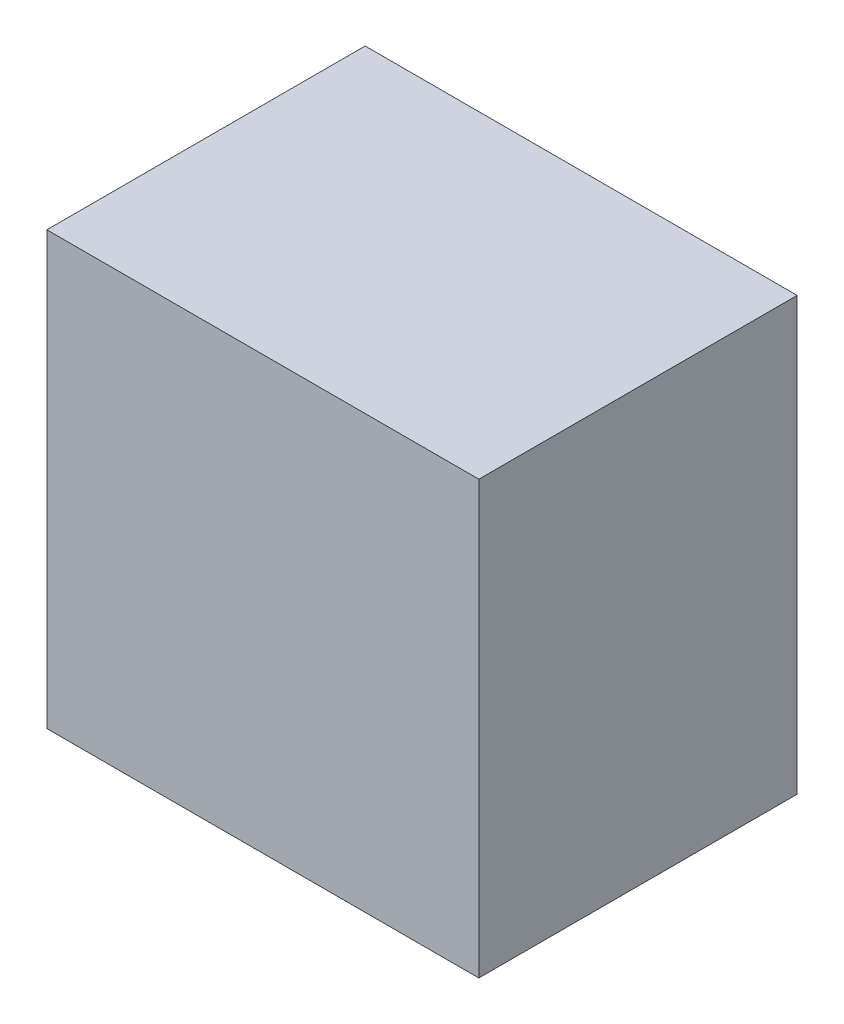
ISO-10303-21;
HEADER;
FILE_DESCRIPTION(('STEP AP214'),'2;1');
FILE_NAME('part.step','',(''),(''),'','','');
FILE_SCHEMA(('AUTOMOTIVE_DESIGN { 1 0 10303 214 1 1 1 1 }'));
ENDSEC;
DATA;
#1=APPLICATION_CONTEXT('core data for automotive mechanical design processes');
#2=APPLICATION_PROTOCOL_DEFINITION('international standard','automotive_design',2000,#1);
#3=PRODUCT_CONTEXT('',#1,'mechanical');
#4=PRODUCT('Part','Part','',(#3));
#5=PRODUCT_RELATED_PRODUCT_CATEGORY('part','',(#4));
#6=PRODUCT_DEFINITION_FORMATION('','',#4);
#7=PRODUCT_DEFINITION_CONTEXT('part definition',#1,'design');
#8=PRODUCT_DEFINITION('design','',#6,#7);
#9=PRODUCT_DEFINITION_SHAPE('','',#8);
#10=(LENGTH_UNIT() NAMED_UNIT(*) SI_UNIT(.MILLI.,.METRE.));
#11=(NAMED_UNIT(*) PLANE_ANGLE_UNIT() SI_UNIT($,.RADIAN.));
#12=(NAMED_UNIT(*) SI_UNIT($,.STERADIAN.) SOLID_ANGLE_UNIT());
#13=UNCERTAINTY_MEASURE_WITH_UNIT(LENGTH_MEASURE(1.E-05),#10,'distance_accuracy_value','');
#14=(GEOMETRIC_REPRESENTATION_CONTEXT(3) GLOBAL_UNCERTAINTY_ASSIGNED_CONTEXT((#13)) GLOBAL_UNIT_ASSIGNED_CONTEXT((#10,
#11,#12)) REPRESENTATION_CONTEXT('',''));
#15=CARTESIAN_POINT('',(0.,0.,0.));
#16=DIRECTION('',(0.,0.,1.));
#17=DIRECTION('',(1.,0.,0.));
#18=AXIS2_PLACEMENT_3D('',#15,#16,#17);
#19=CARTESIAN_POINT('',(0.,0.,0.));
#20=DIRECTION('',(0.,0.,1.));
#21=DIRECTION('',(1.,0.,0.));
#22=AXIS2_PLACEMENT_3D('',#19,#20,#21);
#23=PLANE('',#22);
#24=DIRECTION('',(0.,1.,0.));
#25=VECTOR('',#24,1.);
#26=CARTESIAN_POINT('',(190.,190.,0.));
#27=LINE('',#26,#25);
#28=CARTESIAN_POINT('',(190.,-190.,0.));
#29=VERTEX_POINT('',#28);
#30=CARTESIAN_POINT('',(190.,190.,0.));
#31=VERTEX_POINT('',#30);
#32=EDGE_CURVE('E111',#29,#31,#27,.T.);
#33=ORIENTED_EDGE('',*,*,#32,.F.);
#34=DIRECTION('',(1.,0.,0.));
#35=VECTOR('',#34,1.);
#36=CARTESIAN_POINT('',(-190.,-190.,0.));
#37=LINE('',#36,#35);
#38=CARTESIAN_POINT('',(-190.,-190.,0.));
#39=VERTEX_POINT('',#38);
#40=EDGE_CURVE('E163',#39,#29,#37,.T.);
#41=ORIENTED_EDGE('',*,*,#40,.F.);
#42=DIRECTION('',(0.,-1.,0.));
#43=VECTOR('',#42,1.);
#44=CARTESIAN_POINT('',(-190.,190.,0.));
#45=LINE('',#44,#43);
#46=CARTESIAN_POINT('',(-190.,190.,0.));
#47=VERTEX_POINT('',#46);
#48=EDGE_CURVE('E161',#47,#39,#45,.T.);
#49=ORIENTED_EDGE('',*,*,#48,.F.);
#50=DIRECTION('',(-1.,0.,0.));
#51=VECTOR('',#50,1.);
#52=CARTESIAN_POINT('',(-190.,190.,0.));
#53=LINE('',#52,#51);
#54=EDGE_CURVE('E159',#31,#47,#53,.T.);
#55=ORIENTED_EDGE('',*,*,#54,.F.);
#56=EDGE_LOOP('',(#33,#41,#49,#55));
#57=FACE_BOUND('',#56,.T.);
#58=DIRECTION('',(0.,1.,0.));
#59=VECTOR('',#58,1.);
#60=CARTESIAN_POINT('',(170.,170.,0.));
#61=LINE('',#60,#59);
#62=CARTESIAN_POINT('',(170.,-170.,0.));
#63=VERTEX_POINT('',#62);
#64=CARTESIAN_POINT('',(170.,170.,0.));
#65=VERTEX_POINT('',#64);
#66=EDGE_CURVE('E62',#63,#65,#61,.T.);
#67=ORIENTED_EDGE('',*,*,#66,.T.);
#68=DIRECTION('',(-1.,0.,0.));
#69=VECTOR('',#68,1.);
#70=CARTESIAN_POINT('',(-170.,170.,0.));
#71=LINE('',#70,#69);
#72=CARTESIAN_POINT('',(-170.,170.,0.));
#73=VERTEX_POINT('',#72);
#74=EDGE_CURVE('E143',#65,#73,#71,.T.);
#75=ORIENTED_EDGE('',*,*,#74,.T.);
#76=DIRECTION('',(0.,-1.,0.));
#77=VECTOR('',#76,1.);
#78=CARTESIAN_POINT('',(-170.,170.,0.));
#79=LINE('',#78,#77);
#80=CARTESIAN_POINT('',(-170.,-170.,0.));
#81=VERTEX_POINT('',#80);
#82=EDGE_CURVE('E146',#73,#81,#79,.T.);
#83=ORIENTED_EDGE('',*,*,#82,.T.);
#84=DIRECTION('',(1.,0.,0.));
#85=VECTOR('',#84,1.);
#86=CARTESIAN_POINT('',(-170.,-170.,0.));
#87=LINE('',#86,#85);
#88=EDGE_CURVE('E134',#81,#63,#87,.T.);
#89=ORIENTED_EDGE('',*,*,#88,.T.);
#90=EDGE_LOOP('',(#67,#75,#83,#89));
#91=FACE_BOUND('',#90,.T.);
#92=ADVANCED_FACE('F39',(#57,#91),#23,.F.);
#93=CARTESIAN_POINT('',(190.,190.,260.));
#94=DIRECTION('',(-1.,0.,0.));
#95=DIRECTION('',(0.,-1.,0.));
#96=AXIS2_PLACEMENT_3D('',#93,#94,#95);
#97=PLANE('',#96);
#98=ORIENTED_EDGE('',*,*,#32,.T.);
#99=DIRECTION('',(0.,0.,-1.));
#100=VECTOR('',#99,1.);
#101=CARTESIAN_POINT('',(190.,190.,260.));
#102=LINE('',#101,#100);
#103=CARTESIAN_POINT('',(190.,190.,280.));
#104=VERTEX_POINT('',#103);
#105=EDGE_CURVE('E11',#104,#31,#102,.T.);
#106=ORIENTED_EDGE('',*,*,#105,.F.);
#107=DIRECTION('',(0.,1.,0.));
#108=VECTOR('',#107,1.);
#109=CARTESIAN_POINT('',(190.,190.,280.));
#110=LINE('',#109,#108);
#111=CARTESIAN_POINT('',(190.,-190.,280.));
#112=VERTEX_POINT('',#111);
#113=EDGE_CURVE('E109',#112,#104,#110,.T.);
#114=ORIENTED_EDGE('',*,*,#113,.F.);
#115=DIRECTION('',(0.,0.,-1.));
#116=VECTOR('',#115,1.);
#117=CARTESIAN_POINT('',(190.,-190.,260.));
#118=LINE('',#117,#116);
#119=EDGE_CURVE('E165',#112,#29,#118,.T.);
#120=ORIENTED_EDGE('',*,*,#119,.T.);
#121=EDGE_LOOP('',(#98,#106,#114,#120));
#122=FACE_BOUND('',#121,.T.);
#123=ADVANCED_FACE('F41',(#122),#97,.F.);
#124=CARTESIAN_POINT('',(-190.,190.,260.));
#125=DIRECTION('',(0.,-1.,0.));
#126=DIRECTION('',(0.,0.,-1.));
#127=AXIS2_PLACEMENT_3D('',#124,#125,#126);
#128=PLANE('',#127);
#129=ORIENTED_EDGE('',*,*,#54,.T.);
#130=DIRECTION('',(0.,0.,-1.));
#131=VECTOR('',#130,1.);
#132=CARTESIAN_POINT('',(-190.,190.,260.));
#133=LINE('',#132,#131);
#134=CARTESIAN_POINT('',(-190.,190.,280.));
#135=VERTEX_POINT('',#134);
#136=EDGE_CURVE('E47',#135,#47,#133,.T.);
#137=ORIENTED_EDGE('',*,*,#136,.F.);
#138=DIRECTION('',(-1.,0.,0.));
#139=VECTOR('',#138,1.);
#140=CARTESIAN_POINT('',(-190.,190.,280.));
#141=LINE('',#140,#139);
#142=EDGE_CURVE('E114',#104,#135,#141,.T.);
#143=ORIENTED_EDGE('',*,*,#142,.F.);
#144=ORIENTED_EDGE('',*,*,#105,.T.);
#145=EDGE_LOOP('',(#129,#137,#143,#144));
#146=FACE_BOUND('',#145,.T.);
#147=ADVANCED_FACE('F115',(#146),#128,.F.);
#148=CARTESIAN_POINT('',(-190.,190.,260.));
#149=DIRECTION('',(1.,0.,0.));
#150=DIRECTION('',(0.,1.,0.));
#151=AXIS2_PLACEMENT_3D('',#148,#149,#150);
#152=PLANE('',#151);
#153=ORIENTED_EDGE('',*,*,#48,.T.);
#154=DIRECTION('',(0.,0.,-1.));
#155=VECTOR('',#154,1.);
#156=CARTESIAN_POINT('',(-190.,-190.,260.));
#157=LINE('',#156,#155);
#158=CARTESIAN_POINT('',(-190.,-190.,280.));
#159=VERTEX_POINT('',#158);
#160=EDGE_CURVE('E167',#159,#39,#157,.T.);
#161=ORIENTED_EDGE('',*,*,#160,.F.);
#162=DIRECTION('',(0.,-1.,0.));
#163=VECTOR('',#162,1.);
#164=CARTESIAN_POINT('',(-190.,190.,280.));
#165=LINE('',#164,#163);
#166=EDGE_CURVE('E120',#135,#159,#165,.T.);
#167=ORIENTED_EDGE('',*,*,#166,.F.);
#168=ORIENTED_EDGE('',*,*,#136,.T.);
#169=EDGE_LOOP('',(#153,#161,#167,#168));
#170=FACE_BOUND('',#169,.T.);
#171=ADVANCED_FACE('F171',(#170),#152,.F.);
#172=CARTESIAN_POINT('',(-190.,-190.,260.));
#173=DIRECTION('',(0.,1.,0.));
#174=DIRECTION('',(0.,0.,1.));
#175=AXIS2_PLACEMENT_3D('',#172,#173,#174);
#176=PLANE('',#175);
#177=ORIENTED_EDGE('',*,*,#40,.T.);
#178=ORIENTED_EDGE('',*,*,#119,.F.);
#179=DIRECTION('',(1.,0.,0.));
#180=VECTOR('',#179,1.);
#181=CARTESIAN_POINT('',(-190.,-190.,280.));
#182=LINE('',#181,#180);
#183=EDGE_CURVE('E125',#159,#112,#182,.T.);
#184=ORIENTED_EDGE('',*,*,#183,.F.);
#185=ORIENTED_EDGE('',*,*,#160,.T.);
#186=EDGE_LOOP('',(#177,#178,#184,#185));
#187=FACE_BOUND('',#186,.T.);
#188=ADVANCED_FACE('F176',(#187),#176,.F.);
#189=CARTESIAN_POINT('',(170.,170.,260.));
#190=DIRECTION('',(-1.,0.,0.));
#191=DIRECTION('',(0.,-1.,0.));
#192=AXIS2_PLACEMENT_3D('',#189,#190,#191);
#193=PLANE('',#192);
#194=ORIENTED_EDGE('',*,*,#66,.F.);
#195=DIRECTION('',(0.,0.,-1.));
#196=VECTOR('',#195,1.);
#197=CARTESIAN_POINT('',(170.,-170.,260.));
#198=LINE('',#197,#196);
#199=CARTESIAN_POINT('',(170.,-170.,260.));
#200=VERTEX_POINT('',#199);
#201=EDGE_CURVE('E141',#200,#63,#198,.T.);
#202=ORIENTED_EDGE('',*,*,#201,.F.);
#203=DIRECTION('',(0.,1.,0.));
#204=VECTOR('',#203,1.);
#205=CARTESIAN_POINT('',(170.,170.,260.));
#206=LINE('',#205,#204);
#207=CARTESIAN_POINT('',(170.,170.,260.));
#208=VERTEX_POINT('',#207);
#209=EDGE_CURVE('E130',#200,#208,#206,.T.);
#210=ORIENTED_EDGE('',*,*,#209,.T.);
#211=DIRECTION('',(0.,0.,-1.));
#212=VECTOR('',#211,1.);
#213=CARTESIAN_POINT('',(170.,170.,260.));
#214=LINE('',#213,#212);
#215=EDGE_CURVE('E156',#208,#65,#214,.T.);
#216=ORIENTED_EDGE('',*,*,#215,.T.);
#217=EDGE_LOOP('',(#194,#202,#210,#216));
#218=FACE_BOUND('',#217,.T.);
#219=ADVANCED_FACE('F178',(#218),#193,.T.);
#220=CARTESIAN_POINT('',(-170.,170.,260.));
#221=DIRECTION('',(0.,-1.,0.));
#222=DIRECTION('',(0.,0.,-1.));
#223=AXIS2_PLACEMENT_3D('',#220,#221,#222);
#224=PLANE('',#223);
#225=ORIENTED_EDGE('',*,*,#74,.F.);
#226=ORIENTED_EDGE('',*,*,#215,.F.);
#227=DIRECTION('',(-1.,0.,0.));
#228=VECTOR('',#227,1.);
#229=CARTESIAN_POINT('',(-170.,170.,260.));
#230=LINE('',#229,#228);
#231=CARTESIAN_POINT('',(-170.,170.,260.));
#232=VERTEX_POINT('',#231);
#233=EDGE_CURVE('E133',#208,#232,#230,.T.);
#234=ORIENTED_EDGE('',*,*,#233,.T.);
#235=DIRECTION('',(0.,0.,-1.));
#236=VECTOR('',#235,1.);
#237=CARTESIAN_POINT('',(-170.,170.,260.));
#238=LINE('',#237,#236);
#239=EDGE_CURVE('E154',#232,#73,#238,.T.);
#240=ORIENTED_EDGE('',*,*,#239,.T.);
#241=EDGE_LOOP('',(#225,#226,#234,#240));
#242=FACE_BOUND('',#241,.T.);
#243=ADVANCED_FACE('F184',(#242),#224,.T.);
#244=CARTESIAN_POINT('',(-170.,170.,260.));
#245=DIRECTION('',(1.,0.,0.));
#246=DIRECTION('',(0.,1.,0.));
#247=AXIS2_PLACEMENT_3D('',#244,#245,#246);
#248=PLANE('',#247);
#249=ORIENTED_EDGE('',*,*,#82,.F.);
#250=ORIENTED_EDGE('',*,*,#239,.F.);
#251=DIRECTION('',(0.,-1.,0.));
#252=VECTOR('',#251,1.);
#253=CARTESIAN_POINT('',(-170.,170.,260.));
#254=LINE('',#253,#252);
#255=CARTESIAN_POINT('',(-170.,-170.,260.));
#256=VERTEX_POINT('',#255);
#257=EDGE_CURVE('E137',#232,#256,#254,.T.);
#258=ORIENTED_EDGE('',*,*,#257,.T.);
#259=DIRECTION('',(0.,0.,-1.));
#260=VECTOR('',#259,1.);
#261=CARTESIAN_POINT('',(-170.,-170.,260.));
#262=LINE('',#261,#260);
#263=EDGE_CURVE('E152',#256,#81,#262,.T.);
#264=ORIENTED_EDGE('',*,*,#263,.T.);
#265=EDGE_LOOP('',(#249,#250,#258,#264));
#266=FACE_BOUND('',#265,.T.);
#267=ADVANCED_FACE('F195',(#266),#248,.T.);
#268=CARTESIAN_POINT('',(-170.,-170.,260.));
#269=DIRECTION('',(0.,1.,0.));
#270=DIRECTION('',(0.,0.,1.));
#271=AXIS2_PLACEMENT_3D('',#268,#269,#270);
#272=PLANE('',#271);
#273=ORIENTED_EDGE('',*,*,#88,.F.);
#274=ORIENTED_EDGE('',*,*,#263,.F.);
#275=DIRECTION('',(1.,0.,0.));
#276=VECTOR('',#275,1.);
#277=CARTESIAN_POINT('',(-170.,-170.,260.));
#278=LINE('',#277,#276);
#279=EDGE_CURVE('E54',#256,#200,#278,.T.);
#280=ORIENTED_EDGE('',*,*,#279,.T.);
#281=ORIENTED_EDGE('',*,*,#201,.T.);
#282=EDGE_LOOP('',(#273,#274,#280,#281));
#283=FACE_BOUND('',#282,.T.);
#284=ADVANCED_FACE('F199',(#283),#272,.T.);
#285=CARTESIAN_POINT('',(0.,0.,260.));
#286=DIRECTION('',(0.,0.,1.));
#287=DIRECTION('',(1.,0.,0.));
#288=AXIS2_PLACEMENT_3D('',#285,#286,#287);
#289=PLANE('',#288);
#290=ORIENTED_EDGE('',*,*,#233,.F.);
#291=ORIENTED_EDGE('',*,*,#209,.F.);
#292=ORIENTED_EDGE('',*,*,#279,.F.);
#293=ORIENTED_EDGE('',*,*,#257,.F.);
#294=EDGE_LOOP('',(#290,#291,#292,#293));
#295=FACE_BOUND('',#294,.T.);
#296=ADVANCED_FACE('F203',(#295),#289,.F.);
#297=CARTESIAN_POINT('',(0.,0.,280.));
#298=DIRECTION('',(0.,0.,1.));
#299=DIRECTION('',(1.,0.,0.));
#300=AXIS2_PLACEMENT_3D('',#297,#298,#299);
#301=PLANE('',#300);
#302=ORIENTED_EDGE('',*,*,#113,.T.);
#303=ORIENTED_EDGE('',*,*,#142,.T.);
#304=ORIENTED_EDGE('',*,*,#166,.T.);
#305=ORIENTED_EDGE('',*,*,#183,.T.);
#306=EDGE_LOOP('',(#302,#303,#304,#305));
#307=FACE_BOUND('',#306,.T.);
#308=ADVANCED_FACE('F123',(#307),#301,.T.);
#309=CLOSED_SHELL('',(#92,#123,#147,#171,#188,#219,#243,#267,#284,#296,#308));
#310=MANIFOLD_SOLID_BREP('B2',#309);
#311=ADVANCED_BREP_SHAPE_REPRESENTATION('',(#18,#310),#14);
#312=SHAPE_DEFINITION_REPRESENTATION(#9,#311);
ENDSEC;
END-ISO-10303-21;
